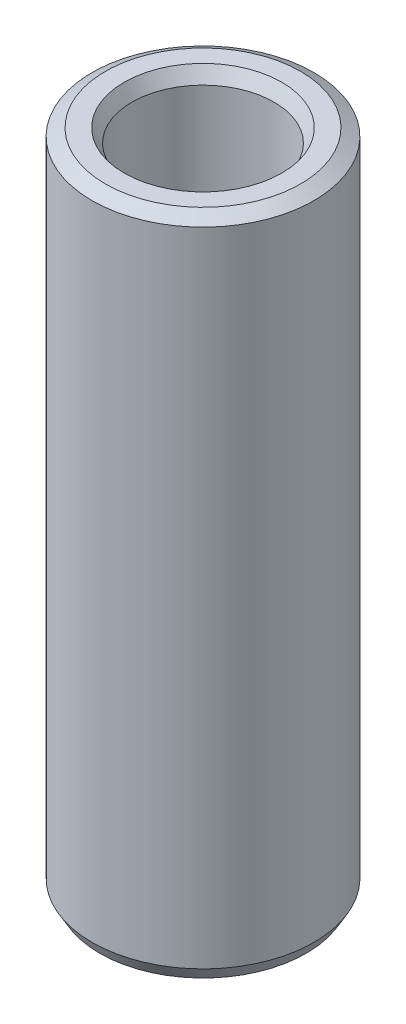
ISO-10303-21;
HEADER;
FILE_DESCRIPTION(('STEP AP214'),'2;1');
FILE_NAME('part.step','',(''),(''),'','','');
FILE_SCHEMA(('AUTOMOTIVE_DESIGN { 1 0 10303 214 1 1 1 1 }'));
ENDSEC;
DATA;
#1=APPLICATION_CONTEXT('core data for automotive mechanical design processes');
#2=APPLICATION_PROTOCOL_DEFINITION('international standard','automotive_design',2000,#1);
#3=PRODUCT_CONTEXT('',#1,'mechanical');
#4=PRODUCT('Part','Part','',(#3));
#5=PRODUCT_RELATED_PRODUCT_CATEGORY('part','',(#4));
#6=PRODUCT_DEFINITION_FORMATION('','',#4);
#7=PRODUCT_DEFINITION_CONTEXT('part definition',#1,'design');
#8=PRODUCT_DEFINITION('design','',#6,#7);
#9=PRODUCT_DEFINITION_SHAPE('','',#8);
#10=(LENGTH_UNIT() NAMED_UNIT(*) SI_UNIT(.MILLI.,.METRE.));
#11=(NAMED_UNIT(*) PLANE_ANGLE_UNIT() SI_UNIT($,.RADIAN.));
#12=(NAMED_UNIT(*) SI_UNIT($,.STERADIAN.) SOLID_ANGLE_UNIT());
#13=UNCERTAINTY_MEASURE_WITH_UNIT(LENGTH_MEASURE(1.E-05),#10,'distance_accuracy_value','');
#14=(GEOMETRIC_REPRESENTATION_CONTEXT(3) GLOBAL_UNCERTAINTY_ASSIGNED_CONTEXT((#13)) GLOBAL_UNIT_ASSIGNED_CONTEXT((#10,
#11,#12)) REPRESENTATION_CONTEXT('',''));
#15=CARTESIAN_POINT('',(0.,0.,0.));
#16=DIRECTION('',(0.,0.,1.));
#17=DIRECTION('',(1.,0.,0.));
#18=AXIS2_PLACEMENT_3D('',#15,#16,#17);
#19=CARTESIAN_POINT('',(0.,254.113138221899,0.));
#20=DIRECTION('',(0.,-1.,0.));
#21=DIRECTION('',(0.,0.,-1.));
#22=AXIS2_PLACEMENT_3D('',#19,#20,#21);
#23=CYLINDRICAL_SURFACE('',#22,42.5);
#24=CARTESIAN_POINT('',(0.,5.12415797530166,0.));
#25=DIRECTION('',(0.,1.,0.));
#26=DIRECTION('',(0.,0.,1.));
#27=AXIS2_PLACEMENT_3D('',#24,#25,#26);
#28=CIRCLE('',#27,42.5);
#29=CARTESIAN_POINT('',(0.,5.12415797530166,42.5));
#30=VERTEX_POINT('',#29);
#31=EDGE_CURVE('E10',#30,#30,#28,.T.);
#32=ORIENTED_EDGE('',*,*,#31,.T.);
#33=EDGE_LOOP('',(#32));
#34=FACE_BOUND('',#33,.T.);
#35=CARTESIAN_POINT('',(0.,251.154704235488,0.));
#36=DIRECTION('',(0.,1.,0.));
#37=DIRECTION('',(0.,0.,1.));
#38=AXIS2_PLACEMENT_3D('',#35,#36,#37);
#39=CIRCLE('',#38,42.5);
#40=CARTESIAN_POINT('',(0.,251.154704235488,42.5));
#41=VERTEX_POINT('',#40);
#42=EDGE_CURVE('E50',#41,#41,#39,.F.);
#43=ORIENTED_EDGE('',*,*,#42,.T.);
#44=EDGE_LOOP('',(#43));
#45=FACE_BOUND('',#44,.T.);
#46=ADVANCED_FACE('F39',(#34,#45),#23,.T.);
#47=CARTESIAN_POINT('',(0.,254.113138221899,0.));
#48=DIRECTION('',(0.,1.,0.));
#49=DIRECTION('',(0.,0.,1.));
#50=AXIS2_PLACEMENT_3D('',#47,#48,#49);
#51=PLANE('',#50);
#52=CARTESIAN_POINT('',(0.,254.113138221899,0.));
#53=DIRECTION('',(0.,1.,0.));
#54=DIRECTION('',(0.,0.,1.));
#55=AXIS2_PLACEMENT_3D('',#52,#53,#54);
#56=CIRCLE('',#55,30.1699779570112);
#57=CARTESIAN_POINT('',(0.,254.113138221899,30.1699779570112));
#58=VERTEX_POINT('',#57);
#59=EDGE_CURVE('E58',#58,#58,#56,.F.);
#60=ORIENTED_EDGE('',*,*,#59,.T.);
#61=EDGE_LOOP('',(#60));
#62=FACE_BOUND('',#61,.T.);
#63=CARTESIAN_POINT('',(0.,254.113138221899,0.));
#64=DIRECTION('',(0.,1.,0.));
#65=DIRECTION('',(0.,0.,1.));
#66=AXIS2_PLACEMENT_3D('',#63,#64,#65);
#67=CIRCLE('',#66,37.3758420246982);
#68=CARTESIAN_POINT('',(0.,254.113138221899,37.3758420246982));
#69=VERTEX_POINT('',#68);
#70=EDGE_CURVE('E61',#69,#69,#67,.T.);
#71=ORIENTED_EDGE('',*,*,#70,.T.);
#72=EDGE_LOOP('',(#71));
#73=FACE_BOUND('',#72,.T.);
#74=ADVANCED_FACE('F88',(#62,#73),#51,.T.);
#75=CARTESIAN_POINT('',(0.,0.,0.));
#76=DIRECTION('',(0.,1.,0.));
#77=DIRECTION('',(0.,0.,1.));
#78=AXIS2_PLACEMENT_3D('',#75,#76,#77);
#79=PLANE('',#78);
#80=CARTESIAN_POINT('',(0.,0.,0.));
#81=DIRECTION('',(0.,1.,0.));
#82=DIRECTION('',(0.,0.,1.));
#83=AXIS2_PLACEMENT_3D('',#80,#81,#82);
#84=CIRCLE('',#83,32.3357019459023);
#85=CARTESIAN_POINT('',(0.,0.,32.3357019459023));
#86=VERTEX_POINT('',#85);
#87=EDGE_CURVE('E51',#86,#86,#84,.T.);
#88=ORIENTED_EDGE('',*,*,#87,.T.);
#89=EDGE_LOOP('',(#88));
#90=FACE_BOUND('',#89,.T.);
#91=CARTESIAN_POINT('',(0.,0.,0.));
#92=DIRECTION('',(0.,1.,0.));
#93=DIRECTION('',(0.,0.,1.));
#94=AXIS2_PLACEMENT_3D('',#91,#92,#93);
#95=CIRCLE('',#94,39.5415660135894);
#96=CARTESIAN_POINT('',(0.,0.,39.5415660135894));
#97=VERTEX_POINT('',#96);
#98=EDGE_CURVE('E54',#97,#97,#95,.F.);
#99=ORIENTED_EDGE('',*,*,#98,.T.);
#100=EDGE_LOOP('',(#99));
#101=FACE_BOUND('',#100,.T.);
#102=ADVANCED_FACE('F83',(#90,#101),#79,.F.);
#103=CARTESIAN_POINT('',(0.,254.113138221899,0.));
#104=DIRECTION('',(0.,-1.,0.));
#105=DIRECTION('',(0.,0.,-1.));
#106=AXIS2_PLACEMENT_3D('',#103,#104,#105);
#107=CYLINDRICAL_SURFACE('',#106,27.2115439706006);
#108=CARTESIAN_POINT('',(0.,248.988980246597,0.));
#109=DIRECTION('',(0.,1.,0.));
#110=DIRECTION('',(0.,0.,1.));
#111=AXIS2_PLACEMENT_3D('',#108,#109,#110);
#112=CIRCLE('',#111,27.2115439706006);
#113=CARTESIAN_POINT('',(0.,248.988980246597,27.2115439706006));
#114=VERTEX_POINT('',#113);
#115=EDGE_CURVE('E67',#114,#114,#112,.T.);
#116=ORIENTED_EDGE('',*,*,#115,.T.);
#117=EDGE_LOOP('',(#116));
#118=FACE_BOUND('',#117,.T.);
#119=CARTESIAN_POINT('',(0.,2.9584339864106,0.));
#120=DIRECTION('',(0.,1.,0.));
#121=DIRECTION('',(0.,0.,1.));
#122=AXIS2_PLACEMENT_3D('',#119,#120,#121);
#123=CIRCLE('',#122,27.2115439706006);
#124=CARTESIAN_POINT('',(0.,2.9584339864106,27.2115439706006));
#125=VERTEX_POINT('',#124);
#126=EDGE_CURVE('E69',#125,#125,#123,.F.);
#127=ORIENTED_EDGE('',*,*,#126,.T.);
#128=EDGE_LOOP('',(#127));
#129=FACE_BOUND('',#128,.T.);
#130=ADVANCED_FACE('F71',(#118,#129),#107,.F.);
#131=CARTESIAN_POINT('',(0.,248.988980246597,0.));
#132=DIRECTION('',(0.,1.,0.));
#133=DIRECTION('',(0.,0.,1.));
#134=AXIS2_PLACEMENT_3D('',#131,#132,#133);
#135=CONICAL_SURFACE('',#134,27.2115439706006,0.5235987755983);
#136=ORIENTED_EDGE('',*,*,#59,.F.);
#137=EDGE_LOOP('',(#136));
#138=FACE_BOUND('',#137,.T.);
#139=ORIENTED_EDGE('',*,*,#115,.F.);
#140=EDGE_LOOP('',(#139));
#141=FACE_BOUND('',#140,.T.);
#142=ADVANCED_FACE('F77',(#138,#141),#135,.F.);
#143=CARTESIAN_POINT('',(0.,0.,0.));
#144=DIRECTION('',(0.,-1.,0.));
#145=DIRECTION('',(0.,0.,-1.));
#146=AXIS2_PLACEMENT_3D('',#143,#144,#145);
#147=CONICAL_SURFACE('',#146,32.3357019459023,1.0471975511966);
#148=ORIENTED_EDGE('',*,*,#126,.F.);
#149=EDGE_LOOP('',(#148));
#150=FACE_BOUND('',#149,.T.);
#151=ORIENTED_EDGE('',*,*,#87,.F.);
#152=EDGE_LOOP('',(#151));
#153=FACE_BOUND('',#152,.T.);
#154=ADVANCED_FACE('F73',(#150,#153),#147,.F.);
#155=CARTESIAN_POINT('',(0.,5.12415797530166,0.));
#156=DIRECTION('',(0.,1.,0.));
#157=DIRECTION('',(0.,0.,1.));
#158=AXIS2_PLACEMENT_3D('',#155,#156,#157);
#159=CONICAL_SURFACE('',#158,42.5,0.523598775598306);
#160=ORIENTED_EDGE('',*,*,#98,.F.);
#161=EDGE_LOOP('',(#160));
#162=FACE_BOUND('',#161,.T.);
#163=ORIENTED_EDGE('',*,*,#31,.F.);
#164=EDGE_LOOP('',(#163));
#165=FACE_BOUND('',#164,.T.);
#166=ADVANCED_FACE('F76',(#162,#165),#159,.T.);
#167=CARTESIAN_POINT('',(0.,254.113138221899,0.));
#168=DIRECTION('',(0.,-1.,0.));
#169=DIRECTION('',(0.,0.,-1.));
#170=AXIS2_PLACEMENT_3D('',#167,#168,#169);
#171=CONICAL_SURFACE('',#170,37.3758420246982,1.04719755119659);
#172=ORIENTED_EDGE('',*,*,#42,.F.);
#173=EDGE_LOOP('',(#172));
#174=FACE_BOUND('',#173,.T.);
#175=ORIENTED_EDGE('',*,*,#70,.F.);
#176=EDGE_LOOP('',(#175));
#177=FACE_BOUND('',#176,.T.);
#178=ADVANCED_FACE('F45',(#174,#177),#171,.T.);
#179=CLOSED_SHELL('',(#46,#74,#102,#130,#142,#154,#166,#178));
#180=MANIFOLD_SOLID_BREP('B2',#179);
#181=ADVANCED_BREP_SHAPE_REPRESENTATION('',(#18,#180),#14);
#182=SHAPE_DEFINITION_REPRESENTATION(#9,#181);
ENDSEC;
END-ISO-10303-21;
